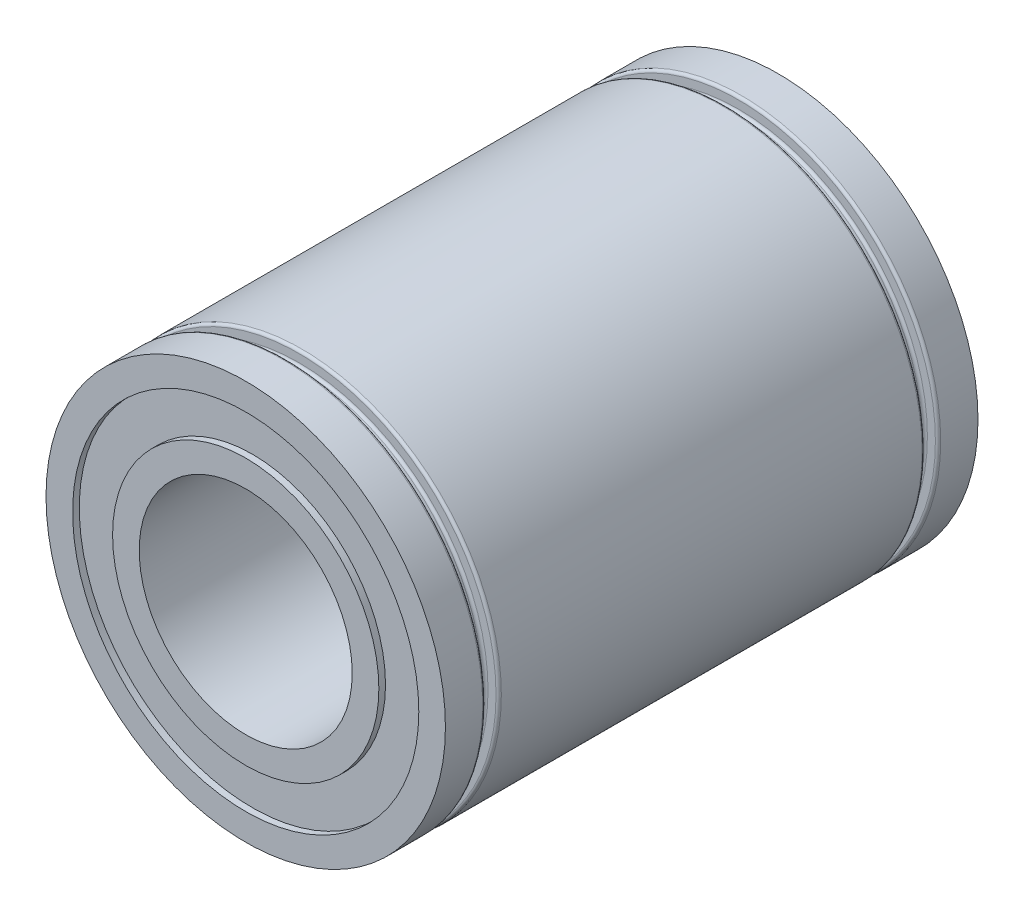
ISO-10303-21;
HEADER;
FILE_DESCRIPTION(('STEP AP214'),'2;1');
FILE_NAME('part.step','',(''),(''),'','','');
FILE_SCHEMA(('AUTOMOTIVE_DESIGN { 1 0 10303 214 1 1 1 1 }'));
ENDSEC;
DATA;
#1=APPLICATION_CONTEXT('core data for automotive mechanical design processes');
#2=APPLICATION_PROTOCOL_DEFINITION('international standard','automotive_design',2000,#1);
#3=PRODUCT_CONTEXT('',#1,'mechanical');
#4=PRODUCT('Part','Part','',(#3));
#5=PRODUCT_RELATED_PRODUCT_CATEGORY('part','',(#4));
#6=PRODUCT_DEFINITION_FORMATION('','',#4);
#7=PRODUCT_DEFINITION_CONTEXT('part definition',#1,'design');
#8=PRODUCT_DEFINITION('design','',#6,#7);
#9=PRODUCT_DEFINITION_SHAPE('','',#8);
#10=(LENGTH_UNIT() NAMED_UNIT(*) SI_UNIT(.MILLI.,.METRE.));
#11=(NAMED_UNIT(*) PLANE_ANGLE_UNIT() SI_UNIT($,.RADIAN.));
#12=(NAMED_UNIT(*) SI_UNIT($,.STERADIAN.) SOLID_ANGLE_UNIT());
#13=UNCERTAINTY_MEASURE_WITH_UNIT(LENGTH_MEASURE(1.E-05),#10,'distance_accuracy_value','');
#14=(GEOMETRIC_REPRESENTATION_CONTEXT(3) GLOBAL_UNCERTAINTY_ASSIGNED_CONTEXT((#13)) GLOBAL_UNIT_ASSIGNED_CONTEXT((#10,
#11,#12)) REPRESENTATION_CONTEXT('',''));
#15=CARTESIAN_POINT('',(0.,0.,0.));
#16=DIRECTION('',(0.,0.,1.));
#17=DIRECTION('',(1.,0.,0.));
#18=AXIS2_PLACEMENT_3D('',#15,#16,#17);
#19=CARTESIAN_POINT('',(0.,0.,10.));
#20=DIRECTION('',(0.,0.,-1.));
#21=DIRECTION('',(-1.,0.,0.));
#22=AXIS2_PLACEMENT_3D('',#19,#20,#21);
#23=CYLINDRICAL_SURFACE('',#22,7.5);
#24=CARTESIAN_POINT('',(0.,0.,-8.6));
#25=DIRECTION('',(0.,0.,1.));
#26=DIRECTION('',(1.,0.,0.));
#27=AXIS2_PLACEMENT_3D('',#24,#25,#26);
#28=CIRCLE('',#27,7.5);
#29=CARTESIAN_POINT('',(7.5,0.,-8.6));
#30=VERTEX_POINT('',#29);
#31=EDGE_CURVE('E81',#30,#30,#28,.F.);
#32=ORIENTED_EDGE('',*,*,#31,.T.);
#33=EDGE_LOOP('',(#32));
#34=FACE_BOUND('',#33,.T.);
#35=CARTESIAN_POINT('',(0.,0.,-10.));
#36=DIRECTION('',(0.,0.,1.));
#37=DIRECTION('',(1.,0.,0.));
#38=AXIS2_PLACEMENT_3D('',#35,#36,#37);
#39=CIRCLE('',#38,7.5);
#40=CARTESIAN_POINT('',(7.5,0.,-10.));
#41=VERTEX_POINT('',#40);
#42=EDGE_CURVE('E121',#41,#41,#39,.T.);
#43=ORIENTED_EDGE('',*,*,#42,.T.);
#44=EDGE_LOOP('',(#43));
#45=FACE_BOUND('',#44,.T.);
#46=ADVANCED_FACE('F40',(#34,#45),#23,.T.);
#47=CARTESIAN_POINT('',(0.,0.,8.6));
#48=DIRECTION('',(0.,0.,-1.));
#49=DIRECTION('',(-1.,0.,0.));
#50=AXIS2_PLACEMENT_3D('',#47,#48,#49);
#51=CIRCLE('',#50,7.5);
#52=CARTESIAN_POINT('',(-7.5,0.,8.6));
#53=VERTEX_POINT('',#52);
#54=EDGE_CURVE('E11',#53,#53,#51,.F.);
#55=ORIENTED_EDGE('',*,*,#54,.T.);
#56=EDGE_LOOP('',(#55));
#57=FACE_BOUND('',#56,.T.);
#58=CARTESIAN_POINT('',(0.,0.,10.));
#59=DIRECTION('',(0.,0.,1.));
#60=DIRECTION('',(1.,0.,0.));
#61=AXIS2_PLACEMENT_3D('',#58,#59,#60);
#62=CIRCLE('',#61,7.5);
#63=CARTESIAN_POINT('',(7.5,0.,10.));
#64=VERTEX_POINT('',#63);
#65=EDGE_CURVE('E120',#64,#64,#62,.T.);
#66=ORIENTED_EDGE('',*,*,#65,.F.);
#67=EDGE_LOOP('',(#66));
#68=FACE_BOUND('',#67,.T.);
#69=ADVANCED_FACE('F142',(#57,#68),#23,.T.);
#70=CARTESIAN_POINT('',(0.,0.,10.));
#71=DIRECTION('',(0.,0.,-1.));
#72=DIRECTION('',(-1.,0.,0.));
#73=AXIS2_PLACEMENT_3D('',#70,#71,#72);
#74=CYLINDRICAL_SURFACE('',#73,5.);
#75=CARTESIAN_POINT('',(0.,0.,-10.));
#76=DIRECTION('',(0.,0.,1.));
#77=DIRECTION('',(1.,0.,0.));
#78=AXIS2_PLACEMENT_3D('',#75,#76,#77);
#79=CIRCLE('',#78,5.);
#80=CARTESIAN_POINT('',(5.,0.,-10.));
#81=VERTEX_POINT('',#80);
#82=EDGE_CURVE('E100',#81,#81,#79,.T.);
#83=ORIENTED_EDGE('',*,*,#82,.T.);
#84=EDGE_LOOP('',(#83));
#85=FACE_BOUND('',#84,.T.);
#86=CARTESIAN_POINT('',(0.,0.,-9.75));
#87=DIRECTION('',(0.,0.,1.));
#88=DIRECTION('',(1.,0.,0.));
#89=AXIS2_PLACEMENT_3D('',#86,#87,#88);
#90=CIRCLE('',#89,5.);
#91=CARTESIAN_POINT('',(5.,0.,-9.75));
#92=VERTEX_POINT('',#91);
#93=EDGE_CURVE('E96',#92,#92,#90,.T.);
#94=ORIENTED_EDGE('',*,*,#93,.F.);
#95=EDGE_LOOP('',(#94));
#96=FACE_BOUND('',#95,.T.);
#97=ADVANCED_FACE('F144',(#85,#96),#74,.T.);
#98=CARTESIAN_POINT('',(0.,0.,10.));
#99=DIRECTION('',(0.,0.,-1.));
#100=DIRECTION('',(-1.,0.,0.));
#101=AXIS2_PLACEMENT_3D('',#98,#99,#100);
#102=CYLINDRICAL_SURFACE('',#101,4.);
#103=CARTESIAN_POINT('',(0.,0.,10.));
#104=DIRECTION('',(0.,0.,1.));
#105=DIRECTION('',(1.,0.,0.));
#106=AXIS2_PLACEMENT_3D('',#103,#104,#105);
#107=CIRCLE('',#106,4.);
#108=CARTESIAN_POINT('',(4.,0.,10.));
#109=VERTEX_POINT('',#108);
#110=EDGE_CURVE('E103',#109,#109,#107,.T.);
#111=ORIENTED_EDGE('',*,*,#110,.T.);
#112=EDGE_LOOP('',(#111));
#113=FACE_BOUND('',#112,.T.);
#114=CARTESIAN_POINT('',(0.,0.,-10.));
#115=DIRECTION('',(0.,0.,1.));
#116=DIRECTION('',(1.,0.,0.));
#117=AXIS2_PLACEMENT_3D('',#114,#115,#116);
#118=CIRCLE('',#117,4.);
#119=CARTESIAN_POINT('',(4.,0.,-10.));
#120=VERTEX_POINT('',#119);
#121=EDGE_CURVE('E104',#120,#120,#118,.T.);
#122=ORIENTED_EDGE('',*,*,#121,.F.);
#123=EDGE_LOOP('',(#122));
#124=FACE_BOUND('',#123,.T.);
#125=ADVANCED_FACE('F151',(#113,#124),#102,.F.);
#126=CARTESIAN_POINT('',(0.,0.,9.75));
#127=DIRECTION('',(0.,0.,1.));
#128=DIRECTION('',(1.,0.,0.));
#129=AXIS2_PLACEMENT_3D('',#126,#127,#128);
#130=CIRCLE('',#129,5.);
#131=CARTESIAN_POINT('',(5.,0.,9.75));
#132=VERTEX_POINT('',#131);
#133=EDGE_CURVE('E107',#132,#132,#130,.T.);
#134=ORIENTED_EDGE('',*,*,#133,.T.);
#135=EDGE_LOOP('',(#134));
#136=FACE_BOUND('',#135,.T.);
#137=CARTESIAN_POINT('',(0.,0.,10.));
#138=DIRECTION('',(0.,0.,1.));
#139=DIRECTION('',(1.,0.,0.));
#140=AXIS2_PLACEMENT_3D('',#137,#138,#139);
#141=CIRCLE('',#140,5.);
#142=CARTESIAN_POINT('',(5.,0.,10.));
#143=VERTEX_POINT('',#142);
#144=EDGE_CURVE('E99',#143,#143,#141,.T.);
#145=ORIENTED_EDGE('',*,*,#144,.F.);
#146=EDGE_LOOP('',(#145));
#147=FACE_BOUND('',#146,.T.);
#148=ADVANCED_FACE('F154',(#136,#147),#74,.T.);
#149=CARTESIAN_POINT('',(0.,0.,10.));
#150=DIRECTION('',(0.,0.,1.));
#151=DIRECTION('',(1.,0.,0.));
#152=AXIS2_PLACEMENT_3D('',#149,#150,#151);
#153=PLANE('',#152);
#154=ORIENTED_EDGE('',*,*,#110,.F.);
#155=EDGE_LOOP('',(#154));
#156=FACE_BOUND('',#155,.T.);
#157=ORIENTED_EDGE('',*,*,#144,.T.);
#158=EDGE_LOOP('',(#157));
#159=FACE_BOUND('',#158,.T.);
#160=ADVANCED_FACE('F375',(#156,#159),#153,.T.);
#161=CARTESIAN_POINT('',(0.,0.,-10.));
#162=DIRECTION('',(0.,0.,1.));
#163=DIRECTION('',(1.,0.,0.));
#164=AXIS2_PLACEMENT_3D('',#161,#162,#163);
#165=PLANE('',#164);
#166=ORIENTED_EDGE('',*,*,#121,.T.);
#167=EDGE_LOOP('',(#166));
#168=FACE_BOUND('',#167,.T.);
#169=ORIENTED_EDGE('',*,*,#82,.F.);
#170=EDGE_LOOP('',(#169));
#171=FACE_BOUND('',#170,.T.);
#172=ADVANCED_FACE('F338',(#168,#171),#165,.F.);
#173=CARTESIAN_POINT('',(0.,0.,9.75));
#174=DIRECTION('',(0.,0.,1.));
#175=DIRECTION('',(1.,0.,0.));
#176=AXIS2_PLACEMENT_3D('',#173,#174,#175);
#177=PLANE('',#176);
#178=ORIENTED_EDGE('',*,*,#133,.F.);
#179=EDGE_LOOP('',(#178));
#180=FACE_BOUND('',#179,.T.);
#181=CARTESIAN_POINT('',(0.,0.,9.75));
#182=DIRECTION('',(0.,0.,1.));
#183=DIRECTION('',(1.,0.,0.));
#184=AXIS2_PLACEMENT_3D('',#181,#182,#183);
#185=CIRCLE('',#184,6.5);
#186=CARTESIAN_POINT('',(6.5,0.,9.75));
#187=VERTEX_POINT('',#186);
#188=EDGE_CURVE('E115',#187,#187,#185,.F.);
#189=ORIENTED_EDGE('',*,*,#188,.F.);
#190=EDGE_LOOP('',(#189));
#191=FACE_BOUND('',#190,.T.);
#192=ADVANCED_FACE('F328',(#180,#191),#177,.T.);
#193=CARTESIAN_POINT('',(0.,0.,-9.75));
#194=DIRECTION('',(0.,0.,1.));
#195=DIRECTION('',(1.,0.,0.));
#196=AXIS2_PLACEMENT_3D('',#193,#194,#195);
#197=PLANE('',#196);
#198=ORIENTED_EDGE('',*,*,#93,.T.);
#199=EDGE_LOOP('',(#198));
#200=FACE_BOUND('',#199,.T.);
#201=CARTESIAN_POINT('',(0.,0.,-9.75));
#202=DIRECTION('',(0.,0.,1.));
#203=DIRECTION('',(1.,0.,0.));
#204=AXIS2_PLACEMENT_3D('',#201,#202,#203);
#205=CIRCLE('',#204,6.5);
#206=CARTESIAN_POINT('',(6.5,0.,-9.75));
#207=VERTEX_POINT('',#206);
#208=EDGE_CURVE('E112',#207,#207,#205,.T.);
#209=ORIENTED_EDGE('',*,*,#208,.F.);
#210=EDGE_LOOP('',(#209));
#211=FACE_BOUND('',#210,.T.);
#212=ADVANCED_FACE('F321',(#200,#211),#197,.F.);
#213=CARTESIAN_POINT('',(0.,0.,10.));
#214=DIRECTION('',(0.,0.,-1.));
#215=DIRECTION('',(-1.,0.,0.));
#216=AXIS2_PLACEMENT_3D('',#213,#214,#215);
#217=CYLINDRICAL_SURFACE('',#216,6.5);
#218=CARTESIAN_POINT('',(0.,0.,-10.));
#219=DIRECTION('',(0.,0.,1.));
#220=DIRECTION('',(1.,0.,0.));
#221=AXIS2_PLACEMENT_3D('',#218,#219,#220);
#222=CIRCLE('',#221,6.5);
#223=CARTESIAN_POINT('',(6.5,0.,-10.));
#224=VERTEX_POINT('',#223);
#225=EDGE_CURVE('E125',#224,#224,#222,.T.);
#226=ORIENTED_EDGE('',*,*,#225,.F.);
#227=EDGE_LOOP('',(#226));
#228=FACE_BOUND('',#227,.T.);
#229=ORIENTED_EDGE('',*,*,#208,.T.);
#230=EDGE_LOOP('',(#229));
#231=FACE_BOUND('',#230,.T.);
#232=ADVANCED_FACE('F327',(#228,#231),#217,.F.);
#233=ORIENTED_EDGE('',*,*,#188,.T.);
#234=EDGE_LOOP('',(#233));
#235=FACE_BOUND('',#234,.T.);
#236=CARTESIAN_POINT('',(0.,0.,10.));
#237=DIRECTION('',(0.,0.,1.));
#238=DIRECTION('',(1.,0.,0.));
#239=AXIS2_PLACEMENT_3D('',#236,#237,#238);
#240=CIRCLE('',#239,6.5);
#241=CARTESIAN_POINT('',(6.5,0.,10.));
#242=VERTEX_POINT('',#241);
#243=EDGE_CURVE('E124',#242,#242,#240,.T.);
#244=ORIENTED_EDGE('',*,*,#243,.T.);
#245=EDGE_LOOP('',(#244));
#246=FACE_BOUND('',#245,.T.);
#247=ADVANCED_FACE('F133',(#235,#246),#217,.F.);
#248=CARTESIAN_POINT('',(0.,0.,10.));
#249=DIRECTION('',(0.,0.,1.));
#250=DIRECTION('',(1.,0.,0.));
#251=AXIS2_PLACEMENT_3D('',#248,#249,#250);
#252=PLANE('',#251);
#253=ORIENTED_EDGE('',*,*,#243,.F.);
#254=EDGE_LOOP('',(#253));
#255=FACE_BOUND('',#254,.T.);
#256=ORIENTED_EDGE('',*,*,#65,.T.);
#257=EDGE_LOOP('',(#256));
#258=FACE_BOUND('',#257,.T.);
#259=ADVANCED_FACE('F135',(#255,#258),#252,.T.);
#260=CARTESIAN_POINT('',(0.,0.,-10.));
#261=DIRECTION('',(0.,0.,1.));
#262=DIRECTION('',(1.,0.,0.));
#263=AXIS2_PLACEMENT_3D('',#260,#261,#262);
#264=PLANE('',#263);
#265=ORIENTED_EDGE('',*,*,#225,.T.);
#266=EDGE_LOOP('',(#265));
#267=FACE_BOUND('',#266,.T.);
#268=ORIENTED_EDGE('',*,*,#42,.F.);
#269=EDGE_LOOP('',(#268));
#270=FACE_BOUND('',#269,.T.);
#271=ADVANCED_FACE('F138',(#267,#270),#264,.F.);
#272=CARTESIAN_POINT('',(7.,0.,8.));
#273=DIRECTION('',(0.,0.,1.));
#274=DIRECTION('',(1.,0.,0.));
#275=AXIS2_PLACEMENT_3D('',#272,#273,#274);
#276=PLANE('',#275);
#277=CARTESIAN_POINT('',(0.,0.,8.));
#278=DIRECTION('',(0.,0.,1.));
#279=DIRECTION('',(1.,0.,0.));
#280=AXIS2_PLACEMENT_3D('',#277,#278,#279);
#281=CIRCLE('',#280,7.1);
#282=CARTESIAN_POINT('',(7.1,0.,8.));
#283=VERTEX_POINT('',#282);
#284=EDGE_CURVE('E47',#283,#283,#281,.F.);
#285=ORIENTED_EDGE('',*,*,#284,.T.);
#286=EDGE_LOOP('',(#285));
#287=FACE_BOUND('',#286,.T.);
#288=CARTESIAN_POINT('',(0.,0.,8.));
#289=DIRECTION('',(0.,0.,1.));
#290=DIRECTION('',(1.,0.,0.));
#291=AXIS2_PLACEMENT_3D('',#288,#289,#290);
#292=CIRCLE('',#291,7.4);
#293=CARTESIAN_POINT('',(7.4,0.,8.));
#294=VERTEX_POINT('',#293);
#295=EDGE_CURVE('E51',#294,#294,#292,.T.);
#296=ORIENTED_EDGE('',*,*,#295,.T.);
#297=EDGE_LOOP('',(#296));
#298=FACE_BOUND('',#297,.T.);
#299=ADVANCED_FACE('F182',(#287,#298),#276,.T.);
#300=CARTESIAN_POINT('',(7.,0.,8.5));
#301=DIRECTION('',(0.,0.,-1.));
#302=DIRECTION('',(-1.,0.,0.));
#303=AXIS2_PLACEMENT_3D('',#300,#301,#302);
#304=PLANE('',#303);
#305=CARTESIAN_POINT('',(0.,0.,8.5));
#306=DIRECTION('',(0.,0.,-1.));
#307=DIRECTION('',(-1.,0.,0.));
#308=AXIS2_PLACEMENT_3D('',#305,#306,#307);
#309=CIRCLE('',#308,7.1);
#310=CARTESIAN_POINT('',(-7.1,0.,8.5));
#311=VERTEX_POINT('',#310);
#312=EDGE_CURVE('E55',#311,#311,#309,.F.);
#313=ORIENTED_EDGE('',*,*,#312,.T.);
#314=EDGE_LOOP('',(#313));
#315=FACE_BOUND('',#314,.T.);
#316=CARTESIAN_POINT('',(0.,0.,8.5));
#317=DIRECTION('',(0.,0.,-1.));
#318=DIRECTION('',(-1.,0.,0.));
#319=AXIS2_PLACEMENT_3D('',#316,#317,#318);
#320=CIRCLE('',#319,7.4);
#321=CARTESIAN_POINT('',(-7.4,0.,8.5));
#322=VERTEX_POINT('',#321);
#323=EDGE_CURVE('E60',#322,#322,#320,.T.);
#324=ORIENTED_EDGE('',*,*,#323,.T.);
#325=EDGE_LOOP('',(#324));
#326=FACE_BOUND('',#325,.T.);
#327=ADVANCED_FACE('F169',(#315,#326),#304,.T.);
#328=CARTESIAN_POINT('',(0.,0.,-10.));
#329=DIRECTION('',(0.,0.,-1.));
#330=DIRECTION('',(-1.,0.,0.));
#331=AXIS2_PLACEMENT_3D('',#328,#329,#330);
#332=CYLINDRICAL_SURFACE('',#331,7.);
#333=CARTESIAN_POINT('',(0.,0.,8.4));
#334=DIRECTION('',(0.,0.,-1.));
#335=DIRECTION('',(-1.,0.,0.));
#336=AXIS2_PLACEMENT_3D('',#333,#334,#335);
#337=CIRCLE('',#336,7.);
#338=CARTESIAN_POINT('',(-7.,0.,8.4));
#339=VERTEX_POINT('',#338);
#340=EDGE_CURVE('E63',#339,#339,#337,.T.);
#341=ORIENTED_EDGE('',*,*,#340,.T.);
#342=EDGE_LOOP('',(#341));
#343=FACE_BOUND('',#342,.T.);
#344=CARTESIAN_POINT('',(0.,0.,8.1));
#345=DIRECTION('',(0.,0.,1.));
#346=DIRECTION('',(1.,0.,0.));
#347=AXIS2_PLACEMENT_3D('',#344,#345,#346);
#348=CIRCLE('',#347,7.);
#349=CARTESIAN_POINT('',(7.,0.,8.1));
#350=VERTEX_POINT('',#349);
#351=EDGE_CURVE('E66',#350,#350,#348,.T.);
#352=ORIENTED_EDGE('',*,*,#351,.T.);
#353=EDGE_LOOP('',(#352));
#354=FACE_BOUND('',#353,.T.);
#355=ADVANCED_FACE('F160',(#343,#354),#332,.T.);
#356=CARTESIAN_POINT('',(0.,0.,-7.9));
#357=DIRECTION('',(0.,0.,-1.));
#358=DIRECTION('',(-1.,0.,0.));
#359=AXIS2_PLACEMENT_3D('',#356,#357,#358);
#360=CIRCLE('',#359,7.5);
#361=CARTESIAN_POINT('',(-7.5,0.,-7.9));
#362=VERTEX_POINT('',#361);
#363=EDGE_CURVE('E69',#362,#362,#360,.F.);
#364=ORIENTED_EDGE('',*,*,#363,.T.);
#365=EDGE_LOOP('',(#364));
#366=FACE_BOUND('',#365,.T.);
#367=CARTESIAN_POINT('',(0.,0.,7.9));
#368=DIRECTION('',(0.,0.,1.));
#369=DIRECTION('',(1.,0.,0.));
#370=AXIS2_PLACEMENT_3D('',#367,#368,#369);
#371=CIRCLE('',#370,7.5);
#372=CARTESIAN_POINT('',(7.5,0.,7.9));
#373=VERTEX_POINT('',#372);
#374=EDGE_CURVE('E72',#373,#373,#371,.F.);
#375=ORIENTED_EDGE('',*,*,#374,.T.);
#376=EDGE_LOOP('',(#375));
#377=FACE_BOUND('',#376,.T.);
#378=ADVANCED_FACE('F146',(#366,#377),#23,.T.);
#379=CARTESIAN_POINT('',(7.,0.,-8.5));
#380=DIRECTION('',(0.,0.,1.));
#381=DIRECTION('',(1.,0.,0.));
#382=AXIS2_PLACEMENT_3D('',#379,#380,#381);
#383=PLANE('',#382);
#384=CARTESIAN_POINT('',(0.,0.,-8.5));
#385=DIRECTION('',(0.,0.,1.));
#386=DIRECTION('',(1.,0.,0.));
#387=AXIS2_PLACEMENT_3D('',#384,#385,#386);
#388=CIRCLE('',#387,7.1);
#389=CARTESIAN_POINT('',(7.1,0.,-8.5));
#390=VERTEX_POINT('',#389);
#391=EDGE_CURVE('E90',#390,#390,#388,.F.);
#392=ORIENTED_EDGE('',*,*,#391,.T.);
#393=EDGE_LOOP('',(#392));
#394=FACE_BOUND('',#393,.T.);
#395=CARTESIAN_POINT('',(0.,0.,-8.5));
#396=DIRECTION('',(0.,0.,1.));
#397=DIRECTION('',(1.,0.,0.));
#398=AXIS2_PLACEMENT_3D('',#395,#396,#397);
#399=CIRCLE('',#398,7.4);
#400=CARTESIAN_POINT('',(7.4,0.,-8.5));
#401=VERTEX_POINT('',#400);
#402=EDGE_CURVE('E93',#401,#401,#399,.T.);
#403=ORIENTED_EDGE('',*,*,#402,.T.);
#404=EDGE_LOOP('',(#403));
#405=FACE_BOUND('',#404,.T.);
#406=ADVANCED_FACE('F159',(#394,#405),#383,.T.);
#407=CARTESIAN_POINT('',(7.,0.,-8.));
#408=DIRECTION('',(0.,0.,-1.));
#409=DIRECTION('',(-1.,0.,0.));
#410=AXIS2_PLACEMENT_3D('',#407,#408,#409);
#411=PLANE('',#410);
#412=CARTESIAN_POINT('',(0.,0.,-8.));
#413=DIRECTION('',(0.,0.,-1.));
#414=DIRECTION('',(-1.,0.,0.));
#415=AXIS2_PLACEMENT_3D('',#412,#413,#414);
#416=CIRCLE('',#415,7.1);
#417=CARTESIAN_POINT('',(-7.1,0.,-8.));
#418=VERTEX_POINT('',#417);
#419=EDGE_CURVE('E75',#418,#418,#416,.F.);
#420=ORIENTED_EDGE('',*,*,#419,.T.);
#421=EDGE_LOOP('',(#420));
#422=FACE_BOUND('',#421,.T.);
#423=CARTESIAN_POINT('',(0.,0.,-8.));
#424=DIRECTION('',(0.,0.,-1.));
#425=DIRECTION('',(-1.,0.,0.));
#426=AXIS2_PLACEMENT_3D('',#423,#424,#425);
#427=CIRCLE('',#426,7.4);
#428=CARTESIAN_POINT('',(-7.4,0.,-8.));
#429=VERTEX_POINT('',#428);
#430=EDGE_CURVE('E78',#429,#429,#427,.T.);
#431=ORIENTED_EDGE('',*,*,#430,.T.);
#432=EDGE_LOOP('',(#431));
#433=FACE_BOUND('',#432,.T.);
#434=ADVANCED_FACE('F166',(#422,#433),#411,.T.);
#435=CARTESIAN_POINT('',(0.,0.,-10.));
#436=DIRECTION('',(0.,0.,-1.));
#437=DIRECTION('',(-1.,0.,0.));
#438=AXIS2_PLACEMENT_3D('',#435,#436,#437);
#439=CYLINDRICAL_SURFACE('',#438,7.);
#440=CARTESIAN_POINT('',(0.,0.,-8.4));
#441=DIRECTION('',(0.,0.,1.));
#442=DIRECTION('',(1.,0.,0.));
#443=AXIS2_PLACEMENT_3D('',#440,#441,#442);
#444=CIRCLE('',#443,7.);
#445=CARTESIAN_POINT('',(7.,0.,-8.4));
#446=VERTEX_POINT('',#445);
#447=EDGE_CURVE('E84',#446,#446,#444,.T.);
#448=ORIENTED_EDGE('',*,*,#447,.T.);
#449=EDGE_LOOP('',(#448));
#450=FACE_BOUND('',#449,.T.);
#451=CARTESIAN_POINT('',(0.,0.,-8.1));
#452=DIRECTION('',(0.,0.,-1.));
#453=DIRECTION('',(-1.,0.,0.));
#454=AXIS2_PLACEMENT_3D('',#451,#452,#453);
#455=CIRCLE('',#454,7.);
#456=CARTESIAN_POINT('',(-7.,0.,-8.1));
#457=VERTEX_POINT('',#456);
#458=EDGE_CURVE('E87',#457,#457,#455,.T.);
#459=ORIENTED_EDGE('',*,*,#458,.T.);
#460=EDGE_LOOP('',(#459));
#461=FACE_BOUND('',#460,.T.);
#462=ADVANCED_FACE('F193',(#450,#461),#439,.T.);
#463=CARTESIAN_POINT('',(0.,0.,-8.4));
#464=DIRECTION('',(0.,0.,1.));
#465=DIRECTION('',(1.,0.,0.));
#466=AXIS2_PLACEMENT_3D('',#463,#464,#465);
#467=TOROIDAL_SURFACE('',#466,7.1,0.1);
#468=ORIENTED_EDGE('',*,*,#447,.F.);
#469=EDGE_LOOP('',(#468));
#470=FACE_BOUND('',#469,.T.);
#471=ORIENTED_EDGE('',*,*,#391,.F.);
#472=EDGE_LOOP('',(#471));
#473=FACE_BOUND('',#472,.T.);
#474=ADVANCED_FACE('F196',(#470,#473),#467,.F.);
#475=CARTESIAN_POINT('',(0.,0.,-8.6));
#476=DIRECTION('',(0.,0.,1.));
#477=DIRECTION('',(1.,0.,0.));
#478=AXIS2_PLACEMENT_3D('',#475,#476,#477);
#479=TOROIDAL_SURFACE('',#478,7.4,0.1);
#480=ORIENTED_EDGE('',*,*,#31,.F.);
#481=EDGE_LOOP('',(#480));
#482=FACE_BOUND('',#481,.T.);
#483=ORIENTED_EDGE('',*,*,#402,.F.);
#484=EDGE_LOOP('',(#483));
#485=FACE_BOUND('',#484,.T.);
#486=ADVANCED_FACE('F218',(#482,#485),#479,.T.);
#487=CARTESIAN_POINT('',(0.,0.,-8.1));
#488=DIRECTION('',(0.,0.,-1.));
#489=DIRECTION('',(-1.,0.,0.));
#490=AXIS2_PLACEMENT_3D('',#487,#488,#489);
#491=TOROIDAL_SURFACE('',#490,7.1,0.1);
#492=ORIENTED_EDGE('',*,*,#419,.F.);
#493=EDGE_LOOP('',(#492));
#494=FACE_BOUND('',#493,.T.);
#495=ORIENTED_EDGE('',*,*,#458,.F.);
#496=EDGE_LOOP('',(#495));
#497=FACE_BOUND('',#496,.T.);
#498=ADVANCED_FACE('F209',(#494,#497),#491,.F.);
#499=CARTESIAN_POINT('',(0.,0.,-7.9));
#500=DIRECTION('',(0.,0.,-1.));
#501=DIRECTION('',(-1.,0.,0.));
#502=AXIS2_PLACEMENT_3D('',#499,#500,#501);
#503=TOROIDAL_SURFACE('',#502,7.4,0.1);
#504=ORIENTED_EDGE('',*,*,#363,.F.);
#505=EDGE_LOOP('',(#504));
#506=FACE_BOUND('',#505,.T.);
#507=ORIENTED_EDGE('',*,*,#430,.F.);
#508=EDGE_LOOP('',(#507));
#509=FACE_BOUND('',#508,.T.);
#510=ADVANCED_FACE('F206',(#506,#509),#503,.T.);
#511=CARTESIAN_POINT('',(0.,0.,8.4));
#512=DIRECTION('',(0.,0.,-1.));
#513=DIRECTION('',(-1.,0.,0.));
#514=AXIS2_PLACEMENT_3D('',#511,#512,#513);
#515=TOROIDAL_SURFACE('',#514,7.1,0.1);
#516=ORIENTED_EDGE('',*,*,#312,.F.);
#517=EDGE_LOOP('',(#516));
#518=FACE_BOUND('',#517,.T.);
#519=ORIENTED_EDGE('',*,*,#340,.F.);
#520=EDGE_LOOP('',(#519));
#521=FACE_BOUND('',#520,.T.);
#522=ADVANCED_FACE('F208',(#518,#521),#515,.F.);
#523=CARTESIAN_POINT('',(0.,0.,8.1));
#524=DIRECTION('',(0.,0.,1.));
#525=DIRECTION('',(1.,0.,0.));
#526=AXIS2_PLACEMENT_3D('',#523,#524,#525);
#527=TOROIDAL_SURFACE('',#526,7.1,0.1);
#528=ORIENTED_EDGE('',*,*,#351,.F.);
#529=EDGE_LOOP('',(#528));
#530=FACE_BOUND('',#529,.T.);
#531=ORIENTED_EDGE('',*,*,#284,.F.);
#532=EDGE_LOOP('',(#531));
#533=FACE_BOUND('',#532,.T.);
#534=ADVANCED_FACE('F179',(#530,#533),#527,.F.);
#535=CARTESIAN_POINT('',(0.,0.,7.9));
#536=DIRECTION('',(0.,0.,1.));
#537=DIRECTION('',(1.,0.,0.));
#538=AXIS2_PLACEMENT_3D('',#535,#536,#537);
#539=TOROIDAL_SURFACE('',#538,7.4,0.1);
#540=ORIENTED_EDGE('',*,*,#374,.F.);
#541=EDGE_LOOP('',(#540));
#542=FACE_BOUND('',#541,.T.);
#543=ORIENTED_EDGE('',*,*,#295,.F.);
#544=EDGE_LOOP('',(#543));
#545=FACE_BOUND('',#544,.T.);
#546=ADVANCED_FACE('F176',(#542,#545),#539,.T.);
#547=CARTESIAN_POINT('',(0.,0.,8.6));
#548=DIRECTION('',(0.,0.,-1.));
#549=DIRECTION('',(-1.,0.,0.));
#550=AXIS2_PLACEMENT_3D('',#547,#548,#549);
#551=TOROIDAL_SURFACE('',#550,7.4,0.1);
#552=ORIENTED_EDGE('',*,*,#54,.F.);
#553=EDGE_LOOP('',(#552));
#554=FACE_BOUND('',#553,.T.);
#555=ORIENTED_EDGE('',*,*,#323,.F.);
#556=EDGE_LOOP('',(#555));
#557=FACE_BOUND('',#556,.T.);
#558=ADVANCED_FACE('F42',(#554,#557),#551,.T.);
#559=CLOSED_SHELL('',(#46,#69,#97,#125,#148,#160,#172,#192,#212,#232,#247,#259,#271,#299,#327,
#355,#378,#406,#434,#462,#474,#486,#498,#510,#522,#534,#546,#558));
#560=MANIFOLD_SOLID_BREP('B2',#559);
#561=ADVANCED_BREP_SHAPE_REPRESENTATION('',(#18,#560),#14);
#562=SHAPE_DEFINITION_REPRESENTATION(#9,#561);
ENDSEC;
END-ISO-10303-21;
